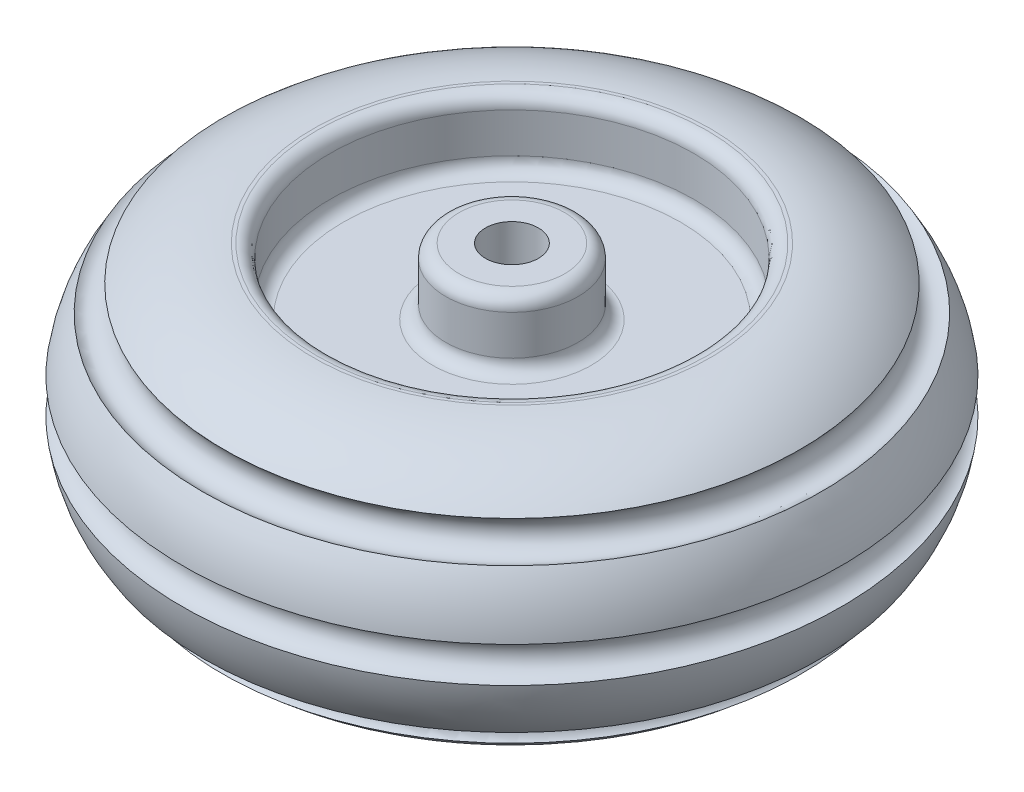
ISO-10303-21;
HEADER;
FILE_DESCRIPTION(('STEP AP214'),'2;1');
FILE_NAME('part.step','',(''),(''),'','','');
FILE_SCHEMA(('AUTOMOTIVE_DESIGN { 1 0 10303 214 1 1 1 1 }'));
ENDSEC;
DATA;
#1=APPLICATION_CONTEXT('core data for automotive mechanical design processes');
#2=APPLICATION_PROTOCOL_DEFINITION('international standard','automotive_design',2000,#1);
#3=PRODUCT_CONTEXT('',#1,'mechanical');
#4=PRODUCT('Part','Part','',(#3));
#5=PRODUCT_RELATED_PRODUCT_CATEGORY('part','',(#4));
#6=PRODUCT_DEFINITION_FORMATION('','',#4);
#7=PRODUCT_DEFINITION_CONTEXT('part definition',#1,'design');
#8=PRODUCT_DEFINITION('design','',#6,#7);
#9=PRODUCT_DEFINITION_SHAPE('','',#8);
#10=(LENGTH_UNIT() NAMED_UNIT(*) SI_UNIT(.MILLI.,.METRE.));
#11=(NAMED_UNIT(*) PLANE_ANGLE_UNIT() SI_UNIT($,.RADIAN.));
#12=(NAMED_UNIT(*) SI_UNIT($,.STERADIAN.) SOLID_ANGLE_UNIT());
#13=UNCERTAINTY_MEASURE_WITH_UNIT(LENGTH_MEASURE(1.E-05),#10,'distance_accuracy_value','');
#14=(GEOMETRIC_REPRESENTATION_CONTEXT(3) GLOBAL_UNCERTAINTY_ASSIGNED_CONTEXT((#13)) GLOBAL_UNIT_ASSIGNED_CONTEXT((#10,
#11,#12)) REPRESENTATION_CONTEXT('',''));
#15=CARTESIAN_POINT('',(0.,0.,0.));
#16=DIRECTION('',(0.,0.,1.));
#17=DIRECTION('',(1.,0.,0.));
#18=AXIS2_PLACEMENT_3D('',#15,#16,#17);
#19=CARTESIAN_POINT('',(22.5,100.,0.));
#20=DIRECTION('',(0.,1.,0.));
#21=DIRECTION('',(0.,0.,1.));
#22=AXIS2_PLACEMENT_3D('',#19,#20,#21);
#23=PLANE('',#22);
#24=CARTESIAN_POINT('',(22.5,100.,0.));
#25=DIRECTION('',(0.,-1.,0.));
#26=DIRECTION('',(0.,0.,-1.));
#27=AXIS2_PLACEMENT_3D('',#24,#25,#26);
#28=CIRCLE('',#27,20.);
#29=CARTESIAN_POINT('',(22.5,100.,-20.));
#30=VERTEX_POINT('',#29);
#31=EDGE_CURVE('E115',#30,#30,#28,.T.);
#32=ORIENTED_EDGE('',*,*,#31,.T.);
#33=EDGE_LOOP('',(#32));
#34=FACE_BOUND('',#33,.T.);
#35=CARTESIAN_POINT('',(22.5,100.,0.));
#36=DIRECTION('',(0.,-1.,0.));
#37=DIRECTION('',(0.,0.,-1.));
#38=AXIS2_PLACEMENT_3D('',#35,#36,#37);
#39=CIRCLE('',#38,40.);
#40=CARTESIAN_POINT('',(22.5,100.,-40.));
#41=VERTEX_POINT('',#40);
#42=EDGE_CURVE('E10',#41,#41,#39,.T.);
#43=ORIENTED_EDGE('',*,*,#42,.F.);
#44=EDGE_LOOP('',(#43));
#45=FACE_BOUND('',#44,.T.);
#46=ADVANCED_FACE('F36',(#34,#45),#23,.T.);
#47=CARTESIAN_POINT('',(22.5,90.,0.));
#48=DIRECTION('',(0.,-1.,0.));
#49=DIRECTION('',(0.,0.,-1.));
#50=AXIS2_PLACEMENT_3D('',#47,#48,#49);
#51=TOROIDAL_SURFACE('',#50,40.,10.);
#52=ORIENTED_EDGE('',*,*,#42,.T.);
#53=EDGE_LOOP('',(#52));
#54=FACE_BOUND('',#53,.T.);
#55=CARTESIAN_POINT('',(22.5,90.,0.));
#56=DIRECTION('',(0.,-1.,0.));
#57=DIRECTION('',(0.,0.,-1.));
#58=AXIS2_PLACEMENT_3D('',#55,#56,#57);
#59=CIRCLE('',#58,50.);
#60=CARTESIAN_POINT('',(22.5,90.,-50.));
#61=VERTEX_POINT('',#60);
#62=EDGE_CURVE('E42',#61,#61,#59,.T.);
#63=ORIENTED_EDGE('',*,*,#62,.F.);
#64=EDGE_LOOP('',(#63));
#65=FACE_BOUND('',#64,.T.);
#66=ADVANCED_FACE('F148',(#54,#65),#51,.T.);
#67=CARTESIAN_POINT('',(22.5,-100.,0.));
#68=DIRECTION('',(0.,-1.,0.));
#69=DIRECTION('',(0.,0.,-1.));
#70=AXIS2_PLACEMENT_3D('',#67,#68,#69);
#71=CYLINDRICAL_SURFACE('',#70,50.);
#72=ORIENTED_EDGE('',*,*,#62,.T.);
#73=EDGE_LOOP('',(#72));
#74=FACE_BOUND('',#73,.T.);
#75=CARTESIAN_POINT('',(22.5,60.,0.));
#76=DIRECTION('',(0.,-1.,0.));
#77=DIRECTION('',(0.,0.,-1.));
#78=AXIS2_PLACEMENT_3D('',#75,#76,#77);
#79=CIRCLE('',#78,50.);
#80=CARTESIAN_POINT('',(22.5,60.,-50.));
#81=VERTEX_POINT('',#80);
#82=EDGE_CURVE('E46',#81,#81,#79,.T.);
#83=ORIENTED_EDGE('',*,*,#82,.F.);
#84=EDGE_LOOP('',(#83));
#85=FACE_BOUND('',#84,.T.);
#86=ADVANCED_FACE('F152',(#74,#85),#71,.T.);
#87=CARTESIAN_POINT('',(22.5,60.,0.));
#88=DIRECTION('',(0.,-1.,0.));
#89=DIRECTION('',(0.,0.,-1.));
#90=AXIS2_PLACEMENT_3D('',#87,#88,#89);
#91=TOROIDAL_SURFACE('',#90,60.,10.);
#92=ORIENTED_EDGE('',*,*,#82,.T.);
#93=EDGE_LOOP('',(#92));
#94=FACE_BOUND('',#93,.T.);
#95=CARTESIAN_POINT('',(22.5,50.,0.));
#96=DIRECTION('',(0.,-1.,0.));
#97=DIRECTION('',(0.,0.,-1.));
#98=AXIS2_PLACEMENT_3D('',#95,#96,#97);
#99=CIRCLE('',#98,60.);
#100=CARTESIAN_POINT('',(22.5,50.,-60.));
#101=VERTEX_POINT('',#100);
#102=EDGE_CURVE('E50',#101,#101,#99,.T.);
#103=ORIENTED_EDGE('',*,*,#102,.F.);
#104=EDGE_LOOP('',(#103));
#105=FACE_BOUND('',#104,.T.);
#106=ADVANCED_FACE('F156',(#94,#105),#91,.F.);
#107=CARTESIAN_POINT('',(82.5,50.,0.));
#108=DIRECTION('',(0.,1.,0.));
#109=DIRECTION('',(0.,0.,1.));
#110=AXIS2_PLACEMENT_3D('',#107,#108,#109);
#111=PLANE('',#110);
#112=ORIENTED_EDGE('',*,*,#102,.T.);
#113=EDGE_LOOP('',(#112));
#114=FACE_BOUND('',#113,.T.);
#115=CARTESIAN_POINT('',(22.5,50.,0.));
#116=DIRECTION('',(0.,-1.,0.));
#117=DIRECTION('',(0.,0.,-1.));
#118=AXIS2_PLACEMENT_3D('',#115,#116,#117);
#119=CIRCLE('',#118,127.5);
#120=CARTESIAN_POINT('',(22.5,50.,-127.5));
#121=VERTEX_POINT('',#120);
#122=EDGE_CURVE('E55',#121,#121,#119,.T.);
#123=ORIENTED_EDGE('',*,*,#122,.F.);
#124=EDGE_LOOP('',(#123));
#125=FACE_BOUND('',#124,.T.);
#126=ADVANCED_FACE('F162',(#114,#125),#111,.T.);
#127=CARTESIAN_POINT('',(22.5,60.,0.));
#128=DIRECTION('',(0.,-1.,0.));
#129=DIRECTION('',(0.,0.,-1.));
#130=AXIS2_PLACEMENT_3D('',#127,#128,#129);
#131=TOROIDAL_SURFACE('',#130,127.5,10.);
#132=ORIENTED_EDGE('',*,*,#122,.T.);
#133=EDGE_LOOP('',(#132));
#134=FACE_BOUND('',#133,.T.);
#135=CARTESIAN_POINT('',(22.5,60.0000000000001,0.));
#136=DIRECTION('',(0.,-1.,0.));
#137=DIRECTION('',(0.,0.,-1.));
#138=AXIS2_PLACEMENT_3D('',#135,#136,#137);
#139=CIRCLE('',#138,137.5);
#140=CARTESIAN_POINT('',(22.5,60.0000000000001,-137.5));
#141=VERTEX_POINT('',#140);
#142=EDGE_CURVE('E58',#141,#141,#139,.T.);
#143=ORIENTED_EDGE('',*,*,#142,.F.);
#144=EDGE_LOOP('',(#143));
#145=FACE_BOUND('',#144,.T.);
#146=ADVANCED_FACE('F166',(#134,#145),#131,.F.);
#147=CARTESIAN_POINT('',(22.5,-100.,0.));
#148=DIRECTION('',(0.,-1.,0.));
#149=DIRECTION('',(0.,0.,-1.));
#150=AXIS2_PLACEMENT_3D('',#147,#148,#149);
#151=CYLINDRICAL_SURFACE('',#150,137.5);
#152=ORIENTED_EDGE('',*,*,#142,.T.);
#153=EDGE_LOOP('',(#152));
#154=FACE_BOUND('',#153,.T.);
#155=CARTESIAN_POINT('',(22.5,90.,0.));
#156=DIRECTION('',(0.,-1.,0.));
#157=DIRECTION('',(0.,0.,-1.));
#158=AXIS2_PLACEMENT_3D('',#155,#156,#157);
#159=CIRCLE('',#158,137.5);
#160=CARTESIAN_POINT('',(22.5,90.,-137.5));
#161=VERTEX_POINT('',#160);
#162=EDGE_CURVE('E61',#161,#161,#159,.T.);
#163=ORIENTED_EDGE('',*,*,#162,.F.);
#164=EDGE_LOOP('',(#163));
#165=FACE_BOUND('',#164,.T.);
#166=ADVANCED_FACE('F170',(#154,#165),#151,.F.);
#167=CARTESIAN_POINT('',(22.5,90.,0.));
#168=DIRECTION('',(0.,-1.,0.));
#169=DIRECTION('',(0.,0.,-1.));
#170=AXIS2_PLACEMENT_3D('',#167,#168,#169);
#171=TOROIDAL_SURFACE('',#170,147.5,10.);
#172=ORIENTED_EDGE('',*,*,#162,.T.);
#173=EDGE_LOOP('',(#172));
#174=FACE_BOUND('',#173,.T.);
#175=CARTESIAN_POINT('',(22.5,100.,0.));
#176=DIRECTION('',(0.,-1.,0.));
#177=DIRECTION('',(0.,0.,-1.));
#178=AXIS2_PLACEMENT_3D('',#175,#176,#177);
#179=CIRCLE('',#178,147.5);
#180=CARTESIAN_POINT('',(22.5,100.,-147.5));
#181=VERTEX_POINT('',#180);
#182=EDGE_CURVE('E64',#181,#181,#179,.T.);
#183=ORIENTED_EDGE('',*,*,#182,.F.);
#184=EDGE_LOOP('',(#183));
#185=FACE_BOUND('',#184,.T.);
#186=ADVANCED_FACE('F174',(#174,#185),#171,.T.);
#187=CARTESIAN_POINT('',(170.,100.,0.));
#188=DIRECTION('',(0.,1.,0.));
#189=DIRECTION('',(0.,0.,1.));
#190=AXIS2_PLACEMENT_3D('',#187,#188,#189);
#191=PLANE('',#190);
#192=ORIENTED_EDGE('',*,*,#182,.T.);
#193=EDGE_LOOP('',(#192));
#194=FACE_BOUND('',#193,.T.);
#195=CARTESIAN_POINT('',(22.5,100.,0.));
#196=DIRECTION('',(0.,-1.,0.));
#197=DIRECTION('',(0.,0.,-1.));
#198=AXIS2_PLACEMENT_3D('',#195,#196,#197);
#199=CIRCLE('',#198,150.);
#200=CARTESIAN_POINT('',(22.5,100.,-150.));
#201=VERTEX_POINT('',#200);
#202=EDGE_CURVE('E67',#201,#201,#199,.T.);
#203=ORIENTED_EDGE('',*,*,#202,.F.);
#204=EDGE_LOOP('',(#203));
#205=FACE_BOUND('',#204,.T.);
#206=ADVANCED_FACE('F178',(#194,#205),#191,.T.);
#207=CARTESIAN_POINT('',(22.5,0.,0.));
#208=DIRECTION('',(0.,-1.,0.));
#209=DIRECTION('',(0.,0.,-1.));
#210=AXIS2_PLACEMENT_3D('',#207,#208,#209);
#211=TOROIDAL_SURFACE('',#210,150.,100.);
#212=ORIENTED_EDGE('',*,*,#202,.T.);
#213=EDGE_LOOP('',(#212));
#214=FACE_BOUND('',#213,.T.);
#215=CARTESIAN_POINT('',(22.5,73.6561850241107,0.));
#216=DIRECTION('',(0.,-1.,0.));
#217=DIRECTION('',(0.,0.,-1.));
#218=AXIS2_PLACEMENT_3D('',#215,#216,#217);
#219=CIRCLE('',#218,217.637019506288);
#220=CARTESIAN_POINT('',(22.5,73.6561850241107,-217.637019506288));
#221=VERTEX_POINT('',#220);
#222=EDGE_CURVE('E70',#221,#221,#219,.T.);
#223=ORIENTED_EDGE('',*,*,#222,.F.);
#224=EDGE_LOOP('',(#223));
#225=FACE_BOUND('',#224,.T.);
#226=ADVANCED_FACE('F182',(#214,#225),#211,.T.);
#227=CARTESIAN_POINT('',(22.5,64.5026489599969,0.));
#228=DIRECTION('',(0.,-1.,0.));
#229=DIRECTION('',(0.,0.,-1.));
#230=AXIS2_PLACEMENT_3D('',#227,#228,#229);
#231=TOROIDAL_SURFACE('',#230,226.416021076365,12.6829843114482);
#232=ORIENTED_EDGE('',*,*,#222,.T.);
#233=EDGE_LOOP('',(#232));
#234=FACE_BOUND('',#233,.T.);
#235=CARTESIAN_POINT('',(22.5,54.3115355979817,0.));
#236=DIRECTION('',(0.,-1.,0.));
#237=DIRECTION('',(0.,0.,-1.));
#238=AXIS2_PLACEMENT_3D('',#235,#236,#237);
#239=CIRCLE('',#238,233.965809118886);
#240=CARTESIAN_POINT('',(22.5,54.3115355979817,-233.965809118886));
#241=VERTEX_POINT('',#240);
#242=EDGE_CURVE('E73',#241,#241,#239,.T.);
#243=ORIENTED_EDGE('',*,*,#242,.F.);
#244=EDGE_LOOP('',(#243));
#245=FACE_BOUND('',#244,.T.);
#246=ADVANCED_FACE('F186',(#234,#245),#231,.F.);
#247=CARTESIAN_POINT('',(22.5,0.,0.));
#248=DIRECTION('',(0.,-1.,0.));
#249=DIRECTION('',(0.,0.,-1.));
#250=AXIS2_PLACEMENT_3D('',#247,#248,#249);
#251=TOROIDAL_SURFACE('',#250,150.,100.);
#252=ORIENTED_EDGE('',*,*,#242,.T.);
#253=EDGE_LOOP('',(#252));
#254=FACE_BOUND('',#253,.T.);
#255=CARTESIAN_POINT('',(22.5,13.4448012327932,0.));
#256=DIRECTION('',(0.,-1.,0.));
#257=DIRECTION('',(0.,0.,-1.));
#258=AXIS2_PLACEMENT_3D('',#255,#256,#257);
#259=CIRCLE('',#258,249.092064868034);
#260=CARTESIAN_POINT('',(22.5,13.4448012327932,-249.092064868034));
#261=VERTEX_POINT('',#260);
#262=EDGE_CURVE('E76',#261,#261,#259,.T.);
#263=ORIENTED_EDGE('',*,*,#262,.F.);
#264=EDGE_LOOP('',(#263));
#265=FACE_BOUND('',#264,.T.);
#266=ADVANCED_FACE('F190',(#254,#265),#251,.T.);
#267=CARTESIAN_POINT('',(22.5,0.,0.));
#268=DIRECTION('',(0.,-1.,0.));
#269=DIRECTION('',(0.,0.,-1.));
#270=AXIS2_PLACEMENT_3D('',#267,#268,#269);
#271=TOROIDAL_SURFACE('',#270,250.,13.4754230506198);
#272=ORIENTED_EDGE('',*,*,#262,.T.);
#273=EDGE_LOOP('',(#272));
#274=FACE_BOUND('',#273,.T.);
#275=CARTESIAN_POINT('',(22.5,-13.4448012327931,0.));
#276=DIRECTION('',(0.,-1.,0.));
#277=DIRECTION('',(0.,0.,-1.));
#278=AXIS2_PLACEMENT_3D('',#275,#276,#277);
#279=CIRCLE('',#278,249.092064868034);
#280=CARTESIAN_POINT('',(22.5,-13.4448012327931,-249.092064868034));
#281=VERTEX_POINT('',#280);
#282=EDGE_CURVE('E79',#281,#281,#279,.T.);
#283=ORIENTED_EDGE('',*,*,#282,.F.);
#284=EDGE_LOOP('',(#283));
#285=FACE_BOUND('',#284,.T.);
#286=ADVANCED_FACE('F194',(#274,#285),#271,.F.);
#287=CARTESIAN_POINT('',(22.5,0.,0.));
#288=DIRECTION('',(0.,-1.,0.));
#289=DIRECTION('',(0.,0.,-1.));
#290=AXIS2_PLACEMENT_3D('',#287,#288,#289);
#291=TOROIDAL_SURFACE('',#290,150.,100.);
#292=ORIENTED_EDGE('',*,*,#282,.T.);
#293=EDGE_LOOP('',(#292));
#294=FACE_BOUND('',#293,.T.);
#295=CARTESIAN_POINT('',(22.5,-55.3986727416396,0.));
#296=DIRECTION('',(0.,-1.,0.));
#297=DIRECTION('',(0.,0.,-1.));
#298=AXIS2_PLACEMENT_3D('',#295,#296,#297);
#299=CIRCLE('',#298,233.252549861639);
#300=CARTESIAN_POINT('',(22.5,-55.3986727416396,-233.252549861639));
#301=VERTEX_POINT('',#300);
#302=EDGE_CURVE('E82',#301,#301,#299,.T.);
#303=ORIENTED_EDGE('',*,*,#302,.F.);
#304=EDGE_LOOP('',(#303));
#305=FACE_BOUND('',#304,.T.);
#306=ADVANCED_FACE('F198',(#294,#305),#291,.T.);
#307=CARTESIAN_POINT('',(22.5,-64.502648959997,0.));
#308=DIRECTION('',(0.,-1.,0.));
#309=DIRECTION('',(0.,0.,-1.));
#310=AXIS2_PLACEMENT_3D('',#307,#308,#309);
#311=TOROIDAL_SURFACE('',#310,226.416021076365,11.3851002989128);
#312=ORIENTED_EDGE('',*,*,#302,.T.);
#313=EDGE_LOOP('',(#312));
#314=FACE_BOUND('',#313,.T.);
#315=CARTESIAN_POINT('',(22.5,-72.7705385605349,0.));
#316=DIRECTION('',(0.,-1.,0.));
#317=DIRECTION('',(0.,0.,-1.));
#318=AXIS2_PLACEMENT_3D('',#315,#316,#317);
#319=CIRCLE('',#318,218.588983937727);
#320=CARTESIAN_POINT('',(22.5,-72.7705385605349,-218.588983937727));
#321=VERTEX_POINT('',#320);
#322=EDGE_CURVE('E85',#321,#321,#319,.T.);
#323=ORIENTED_EDGE('',*,*,#322,.F.);
#324=EDGE_LOOP('',(#323));
#325=FACE_BOUND('',#324,.T.);
#326=ADVANCED_FACE('F202',(#314,#325),#311,.F.);
#327=CARTESIAN_POINT('',(22.5,0.,0.));
#328=DIRECTION('',(0.,-1.,0.));
#329=DIRECTION('',(0.,0.,-1.));
#330=AXIS2_PLACEMENT_3D('',#327,#328,#329);
#331=TOROIDAL_SURFACE('',#330,150.,100.);
#332=ORIENTED_EDGE('',*,*,#322,.T.);
#333=EDGE_LOOP('',(#332));
#334=FACE_BOUND('',#333,.T.);
#335=CARTESIAN_POINT('',(22.5,-100.,0.));
#336=DIRECTION('',(0.,-1.,0.));
#337=DIRECTION('',(0.,0.,-1.));
#338=AXIS2_PLACEMENT_3D('',#335,#336,#337);
#339=CIRCLE('',#338,150.);
#340=CARTESIAN_POINT('',(22.5,-100.,-150.));
#341=VERTEX_POINT('',#340);
#342=EDGE_CURVE('E88',#341,#341,#339,.T.);
#343=ORIENTED_EDGE('',*,*,#342,.F.);
#344=EDGE_LOOP('',(#343));
#345=FACE_BOUND('',#344,.T.);
#346=ADVANCED_FACE('F206',(#334,#345),#331,.T.);
#347=CARTESIAN_POINT('',(170.,-100.,0.));
#348=DIRECTION('',(0.,-1.,0.));
#349=DIRECTION('',(0.,0.,-1.));
#350=AXIS2_PLACEMENT_3D('',#347,#348,#349);
#351=PLANE('',#350);
#352=ORIENTED_EDGE('',*,*,#342,.T.);
#353=EDGE_LOOP('',(#352));
#354=FACE_BOUND('',#353,.T.);
#355=CARTESIAN_POINT('',(22.5,-100.,0.));
#356=DIRECTION('',(0.,-1.,0.));
#357=DIRECTION('',(0.,0.,-1.));
#358=AXIS2_PLACEMENT_3D('',#355,#356,#357);
#359=CIRCLE('',#358,147.5);
#360=CARTESIAN_POINT('',(22.5,-100.,-147.5));
#361=VERTEX_POINT('',#360);
#362=EDGE_CURVE('E91',#361,#361,#359,.T.);
#363=ORIENTED_EDGE('',*,*,#362,.F.);
#364=EDGE_LOOP('',(#363));
#365=FACE_BOUND('',#364,.T.);
#366=ADVANCED_FACE('F210',(#354,#365),#351,.T.);
#367=CARTESIAN_POINT('',(22.5,-90.,0.));
#368=DIRECTION('',(0.,-1.,0.));
#369=DIRECTION('',(0.,0.,-1.));
#370=AXIS2_PLACEMENT_3D('',#367,#368,#369);
#371=TOROIDAL_SURFACE('',#370,147.5,10.);
#372=ORIENTED_EDGE('',*,*,#362,.T.);
#373=EDGE_LOOP('',(#372));
#374=FACE_BOUND('',#373,.T.);
#375=CARTESIAN_POINT('',(22.5,-90.,0.));
#376=DIRECTION('',(0.,-1.,0.));
#377=DIRECTION('',(0.,0.,-1.));
#378=AXIS2_PLACEMENT_3D('',#375,#376,#377);
#379=CIRCLE('',#378,137.5);
#380=CARTESIAN_POINT('',(22.5,-90.,-137.5));
#381=VERTEX_POINT('',#380);
#382=EDGE_CURVE('E94',#381,#381,#379,.T.);
#383=ORIENTED_EDGE('',*,*,#382,.F.);
#384=EDGE_LOOP('',(#383));
#385=FACE_BOUND('',#384,.T.);
#386=ADVANCED_FACE('F214',(#374,#385),#371,.T.);
#387=CARTESIAN_POINT('',(22.5,-100.,0.));
#388=DIRECTION('',(0.,-1.,0.));
#389=DIRECTION('',(0.,0.,-1.));
#390=AXIS2_PLACEMENT_3D('',#387,#388,#389);
#391=CYLINDRICAL_SURFACE('',#390,137.5);
#392=ORIENTED_EDGE('',*,*,#382,.T.);
#393=EDGE_LOOP('',(#392));
#394=FACE_BOUND('',#393,.T.);
#395=CARTESIAN_POINT('',(22.5,-60.,0.));
#396=DIRECTION('',(0.,-1.,0.));
#397=DIRECTION('',(0.,0.,-1.));
#398=AXIS2_PLACEMENT_3D('',#395,#396,#397);
#399=CIRCLE('',#398,137.5);
#400=CARTESIAN_POINT('',(22.5,-60.,-137.5));
#401=VERTEX_POINT('',#400);
#402=EDGE_CURVE('E97',#401,#401,#399,.T.);
#403=ORIENTED_EDGE('',*,*,#402,.F.);
#404=EDGE_LOOP('',(#403));
#405=FACE_BOUND('',#404,.T.);
#406=ADVANCED_FACE('F218',(#394,#405),#391,.F.);
#407=CARTESIAN_POINT('',(22.5,-60.,0.));
#408=DIRECTION('',(0.,-1.,0.));
#409=DIRECTION('',(0.,0.,-1.));
#410=AXIS2_PLACEMENT_3D('',#407,#408,#409);
#411=TOROIDAL_SURFACE('',#410,127.5,10.);
#412=ORIENTED_EDGE('',*,*,#402,.T.);
#413=EDGE_LOOP('',(#412));
#414=FACE_BOUND('',#413,.T.);
#415=CARTESIAN_POINT('',(22.5,-50.,0.));
#416=DIRECTION('',(0.,-1.,0.));
#417=DIRECTION('',(0.,0.,-1.));
#418=AXIS2_PLACEMENT_3D('',#415,#416,#417);
#419=CIRCLE('',#418,127.5);
#420=CARTESIAN_POINT('',(22.5,-50.,-127.5));
#421=VERTEX_POINT('',#420);
#422=EDGE_CURVE('E100',#421,#421,#419,.T.);
#423=ORIENTED_EDGE('',*,*,#422,.F.);
#424=EDGE_LOOP('',(#423));
#425=FACE_BOUND('',#424,.T.);
#426=ADVANCED_FACE('F222',(#414,#425),#411,.F.);
#427=CARTESIAN_POINT('',(82.5,-50.,0.));
#428=DIRECTION('',(0.,-1.,0.));
#429=DIRECTION('',(0.,0.,-1.));
#430=AXIS2_PLACEMENT_3D('',#427,#428,#429);
#431=PLANE('',#430);
#432=ORIENTED_EDGE('',*,*,#422,.T.);
#433=EDGE_LOOP('',(#432));
#434=FACE_BOUND('',#433,.T.);
#435=CARTESIAN_POINT('',(22.5,-50.,0.));
#436=DIRECTION('',(0.,-1.,0.));
#437=DIRECTION('',(0.,0.,-1.));
#438=AXIS2_PLACEMENT_3D('',#435,#436,#437);
#439=CIRCLE('',#438,60.);
#440=CARTESIAN_POINT('',(22.5,-50.,-60.));
#441=VERTEX_POINT('',#440);
#442=EDGE_CURVE('E103',#441,#441,#439,.T.);
#443=ORIENTED_EDGE('',*,*,#442,.F.);
#444=EDGE_LOOP('',(#443));
#445=FACE_BOUND('',#444,.T.);
#446=ADVANCED_FACE('F226',(#434,#445),#431,.T.);
#447=CARTESIAN_POINT('',(22.5,-60.,0.));
#448=DIRECTION('',(0.,-1.,0.));
#449=DIRECTION('',(0.,0.,-1.));
#450=AXIS2_PLACEMENT_3D('',#447,#448,#449);
#451=TOROIDAL_SURFACE('',#450,60.,10.);
#452=ORIENTED_EDGE('',*,*,#442,.T.);
#453=EDGE_LOOP('',(#452));
#454=FACE_BOUND('',#453,.T.);
#455=CARTESIAN_POINT('',(22.5,-60.,0.));
#456=DIRECTION('',(0.,-1.,0.));
#457=DIRECTION('',(0.,0.,-1.));
#458=AXIS2_PLACEMENT_3D('',#455,#456,#457);
#459=CIRCLE('',#458,50.);
#460=CARTESIAN_POINT('',(22.5,-60.,-50.));
#461=VERTEX_POINT('',#460);
#462=EDGE_CURVE('E106',#461,#461,#459,.T.);
#463=ORIENTED_EDGE('',*,*,#462,.F.);
#464=EDGE_LOOP('',(#463));
#465=FACE_BOUND('',#464,.T.);
#466=ADVANCED_FACE('F144',(#454,#465),#451,.F.);
#467=CARTESIAN_POINT('',(22.5,-100.,0.));
#468=DIRECTION('',(0.,-1.,0.));
#469=DIRECTION('',(0.,0.,-1.));
#470=AXIS2_PLACEMENT_3D('',#467,#468,#469);
#471=CYLINDRICAL_SURFACE('',#470,50.);
#472=ORIENTED_EDGE('',*,*,#462,.T.);
#473=EDGE_LOOP('',(#472));
#474=FACE_BOUND('',#473,.T.);
#475=CARTESIAN_POINT('',(22.5,-90.,0.));
#476=DIRECTION('',(0.,-1.,0.));
#477=DIRECTION('',(0.,0.,-1.));
#478=AXIS2_PLACEMENT_3D('',#475,#476,#477);
#479=CIRCLE('',#478,50.);
#480=CARTESIAN_POINT('',(22.5,-90.,-50.));
#481=VERTEX_POINT('',#480);
#482=EDGE_CURVE('E109',#481,#481,#479,.T.);
#483=ORIENTED_EDGE('',*,*,#482,.F.);
#484=EDGE_LOOP('',(#483));
#485=FACE_BOUND('',#484,.T.);
#486=ADVANCED_FACE('F138',(#474,#485),#471,.T.);
#487=CARTESIAN_POINT('',(22.5,-90.,0.));
#488=DIRECTION('',(0.,-1.,0.));
#489=DIRECTION('',(0.,0.,-1.));
#490=AXIS2_PLACEMENT_3D('',#487,#488,#489);
#491=TOROIDAL_SURFACE('',#490,40.,10.);
#492=ORIENTED_EDGE('',*,*,#482,.T.);
#493=EDGE_LOOP('',(#492));
#494=FACE_BOUND('',#493,.T.);
#495=CARTESIAN_POINT('',(22.5,-100.,0.));
#496=DIRECTION('',(0.,-1.,0.));
#497=DIRECTION('',(0.,0.,-1.));
#498=AXIS2_PLACEMENT_3D('',#495,#496,#497);
#499=CIRCLE('',#498,40.);
#500=CARTESIAN_POINT('',(22.5,-100.,-40.));
#501=VERTEX_POINT('',#500);
#502=EDGE_CURVE('E112',#501,#501,#499,.T.);
#503=ORIENTED_EDGE('',*,*,#502,.F.);
#504=EDGE_LOOP('',(#503));
#505=FACE_BOUND('',#504,.T.);
#506=ADVANCED_FACE('F133',(#494,#505),#491,.T.);
#507=CARTESIAN_POINT('',(22.5,-100.,0.));
#508=DIRECTION('',(0.,-1.,0.));
#509=DIRECTION('',(0.,0.,-1.));
#510=AXIS2_PLACEMENT_3D('',#507,#508,#509);
#511=PLANE('',#510);
#512=CARTESIAN_POINT('',(22.5,-100.,0.));
#513=DIRECTION('',(0.,-1.,0.));
#514=DIRECTION('',(0.,0.,-1.));
#515=AXIS2_PLACEMENT_3D('',#512,#513,#514);
#516=CIRCLE('',#515,20.);
#517=CARTESIAN_POINT('',(22.5,-100.,-20.));
#518=VERTEX_POINT('',#517);
#519=EDGE_CURVE('E116',#518,#518,#516,.T.);
#520=ORIENTED_EDGE('',*,*,#519,.F.);
#521=EDGE_LOOP('',(#520));
#522=FACE_BOUND('',#521,.T.);
#523=ORIENTED_EDGE('',*,*,#502,.T.);
#524=EDGE_LOOP('',(#523));
#525=FACE_BOUND('',#524,.T.);
#526=ADVANCED_FACE('F127',(#522,#525),#511,.T.);
#527=CARTESIAN_POINT('',(22.5,100.,0.));
#528=DIRECTION('',(0.,-1.,0.));
#529=DIRECTION('',(0.,0.,-1.));
#530=AXIS2_PLACEMENT_3D('',#527,#528,#529);
#531=CYLINDRICAL_SURFACE('',#530,20.);
#532=ORIENTED_EDGE('',*,*,#31,.F.);
#533=EDGE_LOOP('',(#532));
#534=FACE_BOUND('',#533,.T.);
#535=ORIENTED_EDGE('',*,*,#519,.T.);
#536=EDGE_LOOP('',(#535));
#537=FACE_BOUND('',#536,.T.);
#538=ADVANCED_FACE('F124',(#534,#537),#531,.F.);
#539=CLOSED_SHELL('',(#46,#66,#86,#106,#126,#146,#166,#186,#206,#226,#246,#266,#286,#306,#326,
#346,#366,#386,#406,#426,#446,#466,#486,#506,#526,#538));
#540=MANIFOLD_SOLID_BREP('B2',#539);
#541=ADVANCED_BREP_SHAPE_REPRESENTATION('',(#18,#540),#14);
#542=SHAPE_DEFINITION_REPRESENTATION(#9,#541);
ENDSEC;
END-ISO-10303-21;
